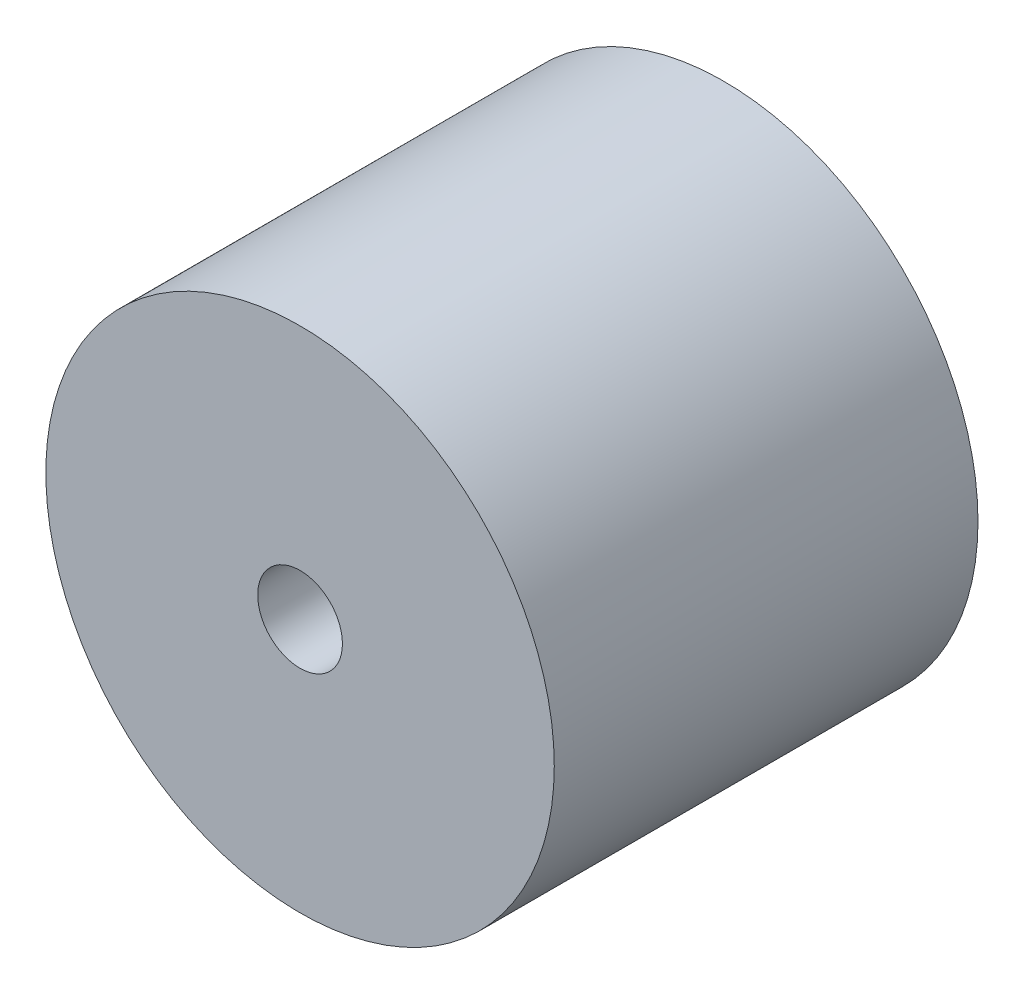
ISO-10303-21;
HEADER;
FILE_DESCRIPTION(('STEP AP214'),'2;1');
FILE_NAME('part.step','',(''),(''),'','','');
FILE_SCHEMA(('AUTOMOTIVE_DESIGN { 1 0 10303 214 1 1 1 1 }'));
ENDSEC;
DATA;
#1=APPLICATION_CONTEXT('core data for automotive mechanical design processes');
#2=APPLICATION_PROTOCOL_DEFINITION('international standard','automotive_design',2000,#1);
#3=PRODUCT_CONTEXT('',#1,'mechanical');
#4=PRODUCT('Part','Part','',(#3));
#5=PRODUCT_RELATED_PRODUCT_CATEGORY('part','',(#4));
#6=PRODUCT_DEFINITION_FORMATION('','',#4);
#7=PRODUCT_DEFINITION_CONTEXT('part definition',#1,'design');
#8=PRODUCT_DEFINITION('design','',#6,#7);
#9=PRODUCT_DEFINITION_SHAPE('','',#8);
#10=(LENGTH_UNIT() NAMED_UNIT(*) SI_UNIT(.MILLI.,.METRE.));
#11=(NAMED_UNIT(*) PLANE_ANGLE_UNIT() SI_UNIT($,.RADIAN.));
#12=(NAMED_UNIT(*) SI_UNIT($,.STERADIAN.) SOLID_ANGLE_UNIT());
#13=UNCERTAINTY_MEASURE_WITH_UNIT(LENGTH_MEASURE(1.E-05),#10,'distance_accuracy_value','');
#14=(GEOMETRIC_REPRESENTATION_CONTEXT(3) GLOBAL_UNCERTAINTY_ASSIGNED_CONTEXT((#13)) GLOBAL_UNIT_ASSIGNED_CONTEXT((#10,
#11,#12)) REPRESENTATION_CONTEXT('',''));
#15=CARTESIAN_POINT('',(0.,0.,0.));
#16=DIRECTION('',(0.,0.,1.));
#17=DIRECTION('',(1.,0.,0.));
#18=AXIS2_PLACEMENT_3D('',#15,#16,#17);
#19=CARTESIAN_POINT('',(0.,0.,15.));
#20=DIRECTION('',(0.,0.,1.));
#21=DIRECTION('',(1.,0.,0.));
#22=AXIS2_PLACEMENT_3D('',#19,#20,#21);
#23=PLANE('',#22);
#24=CARTESIAN_POINT('',(0.,0.,15.));
#25=DIRECTION('',(0.,0.,1.));
#26=DIRECTION('',(1.,0.,0.));
#27=AXIS2_PLACEMENT_3D('',#24,#25,#26);
#28=CIRCLE('',#27,18.);
#29=CARTESIAN_POINT('',(18.,0.,15.));
#30=VERTEX_POINT('',#29);
#31=EDGE_CURVE('E10',#30,#30,#28,.T.);
#32=ORIENTED_EDGE('',*,*,#31,.T.);
#33=EDGE_LOOP('',(#32));
#34=FACE_BOUND('',#33,.T.);
#35=CARTESIAN_POINT('',(0.,0.,15.));
#36=DIRECTION('',(0.,0.,1.));
#37=DIRECTION('',(1.,0.,0.));
#38=AXIS2_PLACEMENT_3D('',#35,#36,#37);
#39=CIRCLE('',#38,3.);
#40=CARTESIAN_POINT('',(3.,0.,15.));
#41=VERTEX_POINT('',#40);
#42=EDGE_CURVE('E50',#41,#41,#39,.T.);
#43=ORIENTED_EDGE('',*,*,#42,.F.);
#44=EDGE_LOOP('',(#43));
#45=FACE_BOUND('',#44,.T.);
#46=ADVANCED_FACE('F37',(#34,#45),#23,.T.);
#47=CARTESIAN_POINT('',(0.,0.,-15.));
#48=DIRECTION('',(0.,0.,1.));
#49=DIRECTION('',(1.,0.,0.));
#50=AXIS2_PLACEMENT_3D('',#47,#48,#49);
#51=PLANE('',#50);
#52=CARTESIAN_POINT('',(0.,0.,-15.));
#53=DIRECTION('',(0.,0.,1.));
#54=DIRECTION('',(1.,0.,0.));
#55=AXIS2_PLACEMENT_3D('',#52,#53,#54);
#56=CIRCLE('',#55,18.);
#57=CARTESIAN_POINT('',(18.,0.,-15.));
#58=VERTEX_POINT('',#57);
#59=EDGE_CURVE('E41',#58,#58,#56,.T.);
#60=ORIENTED_EDGE('',*,*,#59,.F.);
#61=EDGE_LOOP('',(#60));
#62=FACE_BOUND('',#61,.T.);
#63=CARTESIAN_POINT('',(0.,0.,-15.));
#64=DIRECTION('',(0.,0.,1.));
#65=DIRECTION('',(1.,0.,0.));
#66=AXIS2_PLACEMENT_3D('',#63,#64,#65);
#67=CIRCLE('',#66,3.);
#68=CARTESIAN_POINT('',(3.,0.,-15.));
#69=VERTEX_POINT('',#68);
#70=EDGE_CURVE('E52',#69,#69,#67,.T.);
#71=ORIENTED_EDGE('',*,*,#70,.T.);
#72=EDGE_LOOP('',(#71));
#73=FACE_BOUND('',#72,.T.);
#74=ADVANCED_FACE('F64',(#62,#73),#51,.F.);
#75=CARTESIAN_POINT('',(0.,0.,15.));
#76=DIRECTION('',(0.,0.,-1.));
#77=DIRECTION('',(-1.,0.,0.));
#78=AXIS2_PLACEMENT_3D('',#75,#76,#77);
#79=CYLINDRICAL_SURFACE('',#78,18.);
#80=ORIENTED_EDGE('',*,*,#31,.F.);
#81=EDGE_LOOP('',(#80));
#82=FACE_BOUND('',#81,.T.);
#83=ORIENTED_EDGE('',*,*,#59,.T.);
#84=EDGE_LOOP('',(#83));
#85=FACE_BOUND('',#84,.T.);
#86=ADVANCED_FACE('F39',(#82,#85),#79,.T.);
#87=CARTESIAN_POINT('',(0.,0.,15.));
#88=DIRECTION('',(0.,0.,-1.));
#89=DIRECTION('',(-1.,0.,0.));
#90=AXIS2_PLACEMENT_3D('',#87,#88,#89);
#91=CYLINDRICAL_SURFACE('',#90,3.);
#92=ORIENTED_EDGE('',*,*,#42,.T.);
#93=EDGE_LOOP('',(#92));
#94=FACE_BOUND('',#93,.T.);
#95=ORIENTED_EDGE('',*,*,#70,.F.);
#96=EDGE_LOOP('',(#95));
#97=FACE_BOUND('',#96,.T.);
#98=ADVANCED_FACE('F60',(#94,#97),#91,.F.);
#99=CLOSED_SHELL('',(#46,#74,#86,#98));
#100=MANIFOLD_SOLID_BREP('B2',#99);
#101=ADVANCED_BREP_SHAPE_REPRESENTATION('',(#18,#100),#14);
#102=SHAPE_DEFINITION_REPRESENTATION(#9,#101);
ENDSEC;
END-ISO-10303-21;
